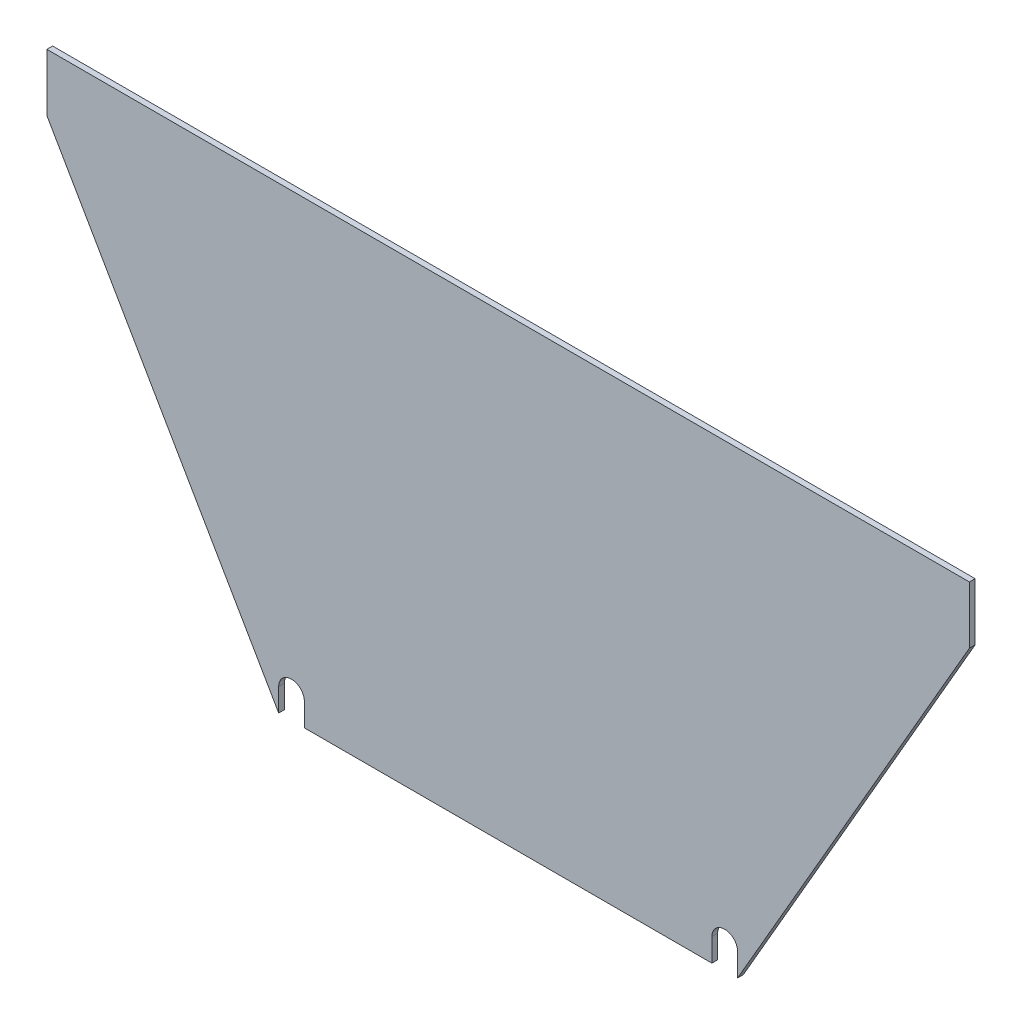
ISO-10303-21;
HEADER;
FILE_DESCRIPTION(('STEP AP214'),'2;1');
FILE_NAME('part.step','',(''),(''),'','','');
FILE_SCHEMA(('AUTOMOTIVE_DESIGN { 1 0 10303 214 1 1 1 1 }'));
ENDSEC;
DATA;
#1=APPLICATION_CONTEXT('core data for automotive mechanical design processes');
#2=APPLICATION_PROTOCOL_DEFINITION('international standard','automotive_design',2000,#1);
#3=PRODUCT_CONTEXT('',#1,'mechanical');
#4=PRODUCT('Part','Part','',(#3));
#5=PRODUCT_RELATED_PRODUCT_CATEGORY('part','',(#4));
#6=PRODUCT_DEFINITION_FORMATION('','',#4);
#7=PRODUCT_DEFINITION_CONTEXT('part definition',#1,'design');
#8=PRODUCT_DEFINITION('design','',#6,#7);
#9=PRODUCT_DEFINITION_SHAPE('','',#8);
#10=(LENGTH_UNIT() NAMED_UNIT(*) SI_UNIT(.MILLI.,.METRE.));
#11=(NAMED_UNIT(*) PLANE_ANGLE_UNIT() SI_UNIT($,.RADIAN.));
#12=(NAMED_UNIT(*) SI_UNIT($,.STERADIAN.) SOLID_ANGLE_UNIT());
#13=UNCERTAINTY_MEASURE_WITH_UNIT(LENGTH_MEASURE(1.E-05),#10,'distance_accuracy_value','');
#14=(GEOMETRIC_REPRESENTATION_CONTEXT(3) GLOBAL_UNCERTAINTY_ASSIGNED_CONTEXT((#13)) GLOBAL_UNIT_ASSIGNED_CONTEXT((#10,
#11,#12)) REPRESENTATION_CONTEXT('',''));
#15=CARTESIAN_POINT('',(0.,0.,0.));
#16=DIRECTION('',(0.,0.,1.));
#17=DIRECTION('',(1.,0.,0.));
#18=AXIS2_PLACEMENT_3D('',#15,#16,#17);
#19=CARTESIAN_POINT('',(0.,0.,6.35));
#20=DIRECTION('',(0.,0.,1.));
#21=DIRECTION('',(1.,0.,0.));
#22=AXIS2_PLACEMENT_3D('',#19,#20,#21);
#23=PLANE('',#22);
#24=DIRECTION('',(0.500000000000017,-0.866025403784429,0.));
#25=VECTOR('',#24,1.);
#26=CARTESIAN_POINT('',(-256.632194654828,444.5,6.35));
#27=LINE('',#26,#25);
#28=CARTESIAN_POINT('',(-1.38962915248915E-11,-1.21939495537996E-11,6.35));
#29=VERTEX_POINT('',#28);
#30=CARTESIAN_POINT('',(-256.632194654828,444.5,6.35));
#31=VERTEX_POINT('',#30);
#32=EDGE_CURVE('E141',#29,#31,#27,.F.);
#33=ORIENTED_EDGE('',*,*,#32,.F.);
#34=DIRECTION('',(0.,1.,0.));
#35=VECTOR('',#34,1.);
#36=CARTESIAN_POINT('',(0.,0.,6.35));
#37=LINE('',#36,#35);
#38=CARTESIAN_POINT('',(0.,25.4,6.35));
#39=VERTEX_POINT('',#38);
#40=EDGE_CURVE('E102',#29,#39,#37,.T.);
#41=ORIENTED_EDGE('',*,*,#40,.T.);
#42=CARTESIAN_POINT('',(14.2136419181508,25.4,6.35));
#43=DIRECTION('',(0.,0.,-1.));
#44=DIRECTION('',(-1.,0.,0.));
#45=AXIS2_PLACEMENT_3D('',#42,#43,#44);
#46=CIRCLE('',#45,14.2136419181508);
#47=CARTESIAN_POINT('',(28.4272838363016,25.4,6.35));
#48=VERTEX_POINT('',#47);
#49=EDGE_CURVE('E20',#39,#48,#46,.T.);
#50=ORIENTED_EDGE('',*,*,#49,.T.);
#51=DIRECTION('',(0.,1.,0.));
#52=VECTOR('',#51,1.);
#53=CARTESIAN_POINT('',(28.4272838363016,25.4,6.35));
#54=LINE('',#53,#52);
#55=CARTESIAN_POINT('',(28.4272838363016,0.,6.35));
#56=VERTEX_POINT('',#55);
#57=EDGE_CURVE('E106',#48,#56,#54,.F.);
#58=ORIENTED_EDGE('',*,*,#57,.T.);
#59=DIRECTION('',(1.,0.,0.));
#60=VECTOR('',#59,1.);
#61=CARTESIAN_POINT('',(0.,0.,6.35));
#62=LINE('',#61,#60);
#63=CARTESIAN_POINT('',(479.5727161638,0.,6.35));
#64=VERTEX_POINT('',#63);
#65=EDGE_CURVE('E118',#64,#56,#62,.F.);
#66=ORIENTED_EDGE('',*,*,#65,.F.);
#67=DIRECTION('',(0.,1.,0.));
#68=VECTOR('',#67,1.);
#69=CARTESIAN_POINT('',(479.5727161638,0.,6.35));
#70=LINE('',#69,#68);
#71=CARTESIAN_POINT('',(479.572716163775,25.4,6.35));
#72=VERTEX_POINT('',#71);
#73=EDGE_CURVE('E183',#64,#72,#70,.T.);
#74=ORIENTED_EDGE('',*,*,#73,.T.);
#75=CARTESIAN_POINT('',(493.7863580819,25.4,6.35));
#76=DIRECTION('',(0.,0.,-1.));
#77=DIRECTION('',(-1.,0.,0.));
#78=AXIS2_PLACEMENT_3D('',#75,#76,#77);
#79=CIRCLE('',#78,14.2136419181508);
#80=CARTESIAN_POINT('',(508.,25.4,6.35));
#81=VERTEX_POINT('',#80);
#82=EDGE_CURVE('E200',#72,#81,#79,.T.);
#83=ORIENTED_EDGE('',*,*,#82,.T.);
#84=DIRECTION('',(0.,1.,0.));
#85=VECTOR('',#84,1.);
#86=CARTESIAN_POINT('',(508.,25.4,6.35));
#87=LINE('',#86,#85);
#88=CARTESIAN_POINT('',(508.,2.00551869693888E-13,6.35));
#89=VERTEX_POINT('',#88);
#90=EDGE_CURVE('E172',#81,#89,#87,.F.);
#91=ORIENTED_EDGE('',*,*,#90,.T.);
#92=DIRECTION('',(0.500000000000017,0.866025403784429,0.));
#93=VECTOR('',#92,1.);
#94=CARTESIAN_POINT('',(508.,0.,6.35));
#95=LINE('',#94,#93);
#96=CARTESIAN_POINT('',(764.632194654821,444.500000000004,6.35));
#97=VERTEX_POINT('',#96);
#98=EDGE_CURVE('E170',#97,#89,#95,.F.);
#99=ORIENTED_EDGE('',*,*,#98,.F.);
#100=DIRECTION('',(0.,1.,0.));
#101=VECTOR('',#100,1.);
#102=CARTESIAN_POINT('',(764.632194654828,444.5,6.35));
#103=LINE('',#102,#101);
#104=CARTESIAN_POINT('',(764.632194654828,508.,6.35));
#105=VERTEX_POINT('',#104);
#106=EDGE_CURVE('E162',#105,#97,#103,.F.);
#107=ORIENTED_EDGE('',*,*,#106,.F.);
#108=DIRECTION('',(1.,0.,0.));
#109=VECTOR('',#108,1.);
#110=CARTESIAN_POINT('',(764.632194654828,508.,6.35));
#111=LINE('',#110,#109);
#112=CARTESIAN_POINT('',(-256.632194654828,508.,6.35));
#113=VERTEX_POINT('',#112);
#114=EDGE_CURVE('E154',#113,#105,#111,.T.);
#115=ORIENTED_EDGE('',*,*,#114,.F.);
#116=DIRECTION('',(0.,1.,0.));
#117=VECTOR('',#116,1.);
#118=CARTESIAN_POINT('',(-256.632194654828,508.,6.35));
#119=LINE('',#118,#117);
#120=EDGE_CURVE('E146',#31,#113,#119,.T.);
#121=ORIENTED_EDGE('',*,*,#120,.F.);
#122=EDGE_LOOP('',(#33,#41,#50,#58,#66,#74,#83,#91,#99,#107,#115,#121));
#123=FACE_BOUND('',#122,.T.);
#124=ADVANCED_FACE('F17',(#123),#23,.T.);
#125=CARTESIAN_POINT('',(0.,0.,0.));
#126=DIRECTION('',(-1.,0.,0.));
#127=DIRECTION('',(0.,0.,1.));
#128=AXIS2_PLACEMENT_3D('',#125,#126,#127);
#129=PLANE('',#128);
#130=ORIENTED_EDGE('',*,*,#40,.F.);
#131=DIRECTION('',(0.,0.,1.));
#132=VECTOR('',#131,1.);
#133=CARTESIAN_POINT('',(-2.08721928629529E-11,-1.21569421196455E-11,0.));
#134=LINE('',#133,#132);
#135=CARTESIAN_POINT('',(-6.95739762098431E-12,-4.05231403988182E-12,0.));
#136=VERTEX_POINT('',#135);
#137=EDGE_CURVE('E130',#136,#29,#134,.T.);
#138=ORIENTED_EDGE('',*,*,#137,.F.);
#139=DIRECTION('',(0.,1.,0.));
#140=VECTOR('',#139,1.);
#141=CARTESIAN_POINT('',(0.,0.,0.));
#142=LINE('',#141,#140);
#143=CARTESIAN_POINT('',(0.,25.4,0.));
#144=VERTEX_POINT('',#143);
#145=EDGE_CURVE('E133',#136,#144,#142,.T.);
#146=ORIENTED_EDGE('',*,*,#145,.T.);
#147=DIRECTION('',(0.,0.,-1.));
#148=VECTOR('',#147,1.);
#149=CARTESIAN_POINT('',(0.,25.4,0.));
#150=LINE('',#149,#148);
#151=EDGE_CURVE('E112',#144,#39,#150,.F.);
#152=ORIENTED_EDGE('',*,*,#151,.T.);
#153=EDGE_LOOP('',(#130,#138,#146,#152));
#154=FACE_BOUND('',#153,.T.);
#155=ADVANCED_FACE('F373',(#154),#129,.F.);
#156=CARTESIAN_POINT('',(14.2136419181508,25.4,0.));
#157=DIRECTION('',(0.,0.,-1.));
#158=DIRECTION('',(-1.,0.,0.));
#159=AXIS2_PLACEMENT_3D('',#156,#157,#158);
#160=CYLINDRICAL_SURFACE('',#159,14.2136419181508);
#161=ORIENTED_EDGE('',*,*,#49,.F.);
#162=ORIENTED_EDGE('',*,*,#151,.F.);
#163=CARTESIAN_POINT('',(14.2136419181508,25.4,0.));
#164=DIRECTION('',(0.,0.,-1.));
#165=DIRECTION('',(-1.,0.,0.));
#166=AXIS2_PLACEMENT_3D('',#163,#164,#165);
#167=CIRCLE('',#166,14.2136419181508);
#168=CARTESIAN_POINT('',(28.4272838363016,25.4,0.));
#169=VERTEX_POINT('',#168);
#170=EDGE_CURVE('E123',#144,#169,#167,.T.);
#171=ORIENTED_EDGE('',*,*,#170,.T.);
#172=DIRECTION('',(0.,0.,-1.));
#173=VECTOR('',#172,1.);
#174=CARTESIAN_POINT('',(28.4272838363016,25.4,0.));
#175=LINE('',#174,#173);
#176=EDGE_CURVE('E111',#169,#48,#175,.F.);
#177=ORIENTED_EDGE('',*,*,#176,.T.);
#178=EDGE_LOOP('',(#161,#162,#171,#177));
#179=FACE_BOUND('',#178,.T.);
#180=ADVANCED_FACE('F121',(#179),#160,.F.);
#181=CARTESIAN_POINT('',(28.4272838363016,25.4,0.));
#182=DIRECTION('',(1.,0.,0.));
#183=DIRECTION('',(0.,0.,-1.));
#184=AXIS2_PLACEMENT_3D('',#181,#182,#183);
#185=PLANE('',#184);
#186=ORIENTED_EDGE('',*,*,#57,.F.);
#187=ORIENTED_EDGE('',*,*,#176,.F.);
#188=DIRECTION('',(0.,1.,0.));
#189=VECTOR('',#188,1.);
#190=CARTESIAN_POINT('',(28.4272838363016,0.,0.));
#191=LINE('',#190,#189);
#192=CARTESIAN_POINT('',(28.4272838363016,0.,0.));
#193=VERTEX_POINT('',#192);
#194=EDGE_CURVE('E199',#169,#193,#191,.F.);
#195=ORIENTED_EDGE('',*,*,#194,.T.);
#196=DIRECTION('',(0.,0.,-1.));
#197=VECTOR('',#196,1.);
#198=CARTESIAN_POINT('',(28.4272838363016,0.,0.));
#199=LINE('',#198,#197);
#200=EDGE_CURVE('E117',#56,#193,#199,.T.);
#201=ORIENTED_EDGE('',*,*,#200,.F.);
#202=EDGE_LOOP('',(#186,#187,#195,#201));
#203=FACE_BOUND('',#202,.T.);
#204=ADVANCED_FACE('F114',(#203),#185,.F.);
#205=CARTESIAN_POINT('',(0.,0.,0.));
#206=DIRECTION('',(0.,-1.,0.));
#207=DIRECTION('',(0.,0.,-1.));
#208=AXIS2_PLACEMENT_3D('',#205,#206,#207);
#209=PLANE('',#208);
#210=ORIENTED_EDGE('',*,*,#65,.T.);
#211=ORIENTED_EDGE('',*,*,#200,.T.);
#212=DIRECTION('',(1.,0.,0.));
#213=VECTOR('',#212,1.);
#214=CARTESIAN_POINT('',(0.,0.,0.));
#215=LINE('',#214,#213);
#216=CARTESIAN_POINT('',(479.5727161638,0.,0.));
#217=VERTEX_POINT('',#216);
#218=EDGE_CURVE('E218',#193,#217,#215,.T.);
#219=ORIENTED_EDGE('',*,*,#218,.T.);
#220=DIRECTION('',(0.,0.,1.));
#221=VECTOR('',#220,1.);
#222=CARTESIAN_POINT('',(479.5727161638,0.,0.));
#223=LINE('',#222,#221);
#224=EDGE_CURVE('E186',#217,#64,#223,.T.);
#225=ORIENTED_EDGE('',*,*,#224,.T.);
#226=EDGE_LOOP('',(#210,#211,#219,#225));
#227=FACE_BOUND('',#226,.T.);
#228=ADVANCED_FACE('F224',(#227),#209,.T.);
#229=CARTESIAN_POINT('',(479.5727161638,0.,0.));
#230=DIRECTION('',(-1.,0.,0.));
#231=DIRECTION('',(0.,0.,1.));
#232=AXIS2_PLACEMENT_3D('',#229,#230,#231);
#233=PLANE('',#232);
#234=ORIENTED_EDGE('',*,*,#73,.F.);
#235=ORIENTED_EDGE('',*,*,#224,.F.);
#236=DIRECTION('',(0.,1.,0.));
#237=VECTOR('',#236,1.);
#238=CARTESIAN_POINT('',(479.5727161638,0.,0.));
#239=LINE('',#238,#237);
#240=CARTESIAN_POINT('',(479.572716163775,25.4,0.));
#241=VERTEX_POINT('',#240);
#242=EDGE_CURVE('E198',#217,#241,#239,.T.);
#243=ORIENTED_EDGE('',*,*,#242,.T.);
#244=DIRECTION('',(0.,0.,-1.));
#245=VECTOR('',#244,1.);
#246=CARTESIAN_POINT('',(479.572716163749,25.4,0.));
#247=LINE('',#246,#245);
#248=EDGE_CURVE('E185',#241,#72,#247,.F.);
#249=ORIENTED_EDGE('',*,*,#248,.T.);
#250=EDGE_LOOP('',(#234,#235,#243,#249));
#251=FACE_BOUND('',#250,.T.);
#252=ADVANCED_FACE('F264',(#251),#233,.F.);
#253=CARTESIAN_POINT('',(493.7863580819,25.4,0.));
#254=DIRECTION('',(0.,0.,-1.));
#255=DIRECTION('',(-1.,0.,0.));
#256=AXIS2_PLACEMENT_3D('',#253,#254,#255);
#257=CYLINDRICAL_SURFACE('',#256,14.2136419181508);
#258=ORIENTED_EDGE('',*,*,#82,.F.);
#259=ORIENTED_EDGE('',*,*,#248,.F.);
#260=CARTESIAN_POINT('',(493.7863580819,25.4,0.));
#261=DIRECTION('',(0.,0.,-1.));
#262=DIRECTION('',(-1.,0.,0.));
#263=AXIS2_PLACEMENT_3D('',#260,#261,#262);
#264=CIRCLE('',#263,14.2136419181508);
#265=CARTESIAN_POINT('',(508.,25.4,0.));
#266=VERTEX_POINT('',#265);
#267=EDGE_CURVE('E194',#241,#266,#264,.T.);
#268=ORIENTED_EDGE('',*,*,#267,.T.);
#269=DIRECTION('',(0.,0.,-1.));
#270=VECTOR('',#269,1.);
#271=CARTESIAN_POINT('',(508.,25.4,0.));
#272=LINE('',#271,#270);
#273=EDGE_CURVE('E180',#266,#81,#272,.F.);
#274=ORIENTED_EDGE('',*,*,#273,.T.);
#275=EDGE_LOOP('',(#258,#259,#268,#274));
#276=FACE_BOUND('',#275,.T.);
#277=ADVANCED_FACE('F266',(#276),#257,.F.);
#278=CARTESIAN_POINT('',(508.,25.4,0.));
#279=DIRECTION('',(1.,0.,0.));
#280=DIRECTION('',(0.,0.,-1.));
#281=AXIS2_PLACEMENT_3D('',#278,#279,#280);
#282=PLANE('',#281);
#283=ORIENTED_EDGE('',*,*,#90,.F.);
#284=ORIENTED_EDGE('',*,*,#273,.F.);
#285=DIRECTION('',(0.,1.,0.));
#286=VECTOR('',#285,1.);
#287=CARTESIAN_POINT('',(508.,0.,0.));
#288=LINE('',#287,#286);
#289=CARTESIAN_POINT('',(508.,0.,0.));
#290=VERTEX_POINT('',#289);
#291=EDGE_CURVE('E197',#266,#290,#288,.F.);
#292=ORIENTED_EDGE('',*,*,#291,.T.);
#293=DIRECTION('',(0.,0.,1.));
#294=VECTOR('',#293,1.);
#295=CARTESIAN_POINT('',(508.,2.01857113071048E-13,0.));
#296=LINE('',#295,#294);
#297=EDGE_CURVE('E164',#89,#290,#296,.F.);
#298=ORIENTED_EDGE('',*,*,#297,.F.);
#299=EDGE_LOOP('',(#283,#284,#292,#298));
#300=FACE_BOUND('',#299,.T.);
#301=ADVANCED_FACE('F258',(#300),#282,.F.);
#302=CARTESIAN_POINT('',(508.,0.,0.));
#303=DIRECTION('',(0.866025403784429,-0.500000000000017,0.));
#304=DIRECTION('',(0.500000000000017,0.866025403784429,0.));
#305=AXIS2_PLACEMENT_3D('',#302,#303,#304);
#306=PLANE('',#305);
#307=ORIENTED_EDGE('',*,*,#98,.T.);
#308=ORIENTED_EDGE('',*,*,#297,.T.);
#309=DIRECTION('',(0.500000000000058,0.866025403784406,0.));
#310=VECTOR('',#309,1.);
#311=CARTESIAN_POINT('',(508.,0.,0.));
#312=LINE('',#311,#310);
#313=CARTESIAN_POINT('',(764.632194654818,444.500000000006,0.));
#314=VERTEX_POINT('',#313);
#315=EDGE_CURVE('E241',#290,#314,#312,.T.);
#316=ORIENTED_EDGE('',*,*,#315,.T.);
#317=DIRECTION('',(0.,0.,-1.));
#318=VECTOR('',#317,1.);
#319=CARTESIAN_POINT('',(764.632194654828,444.5,0.));
#320=LINE('',#319,#318);
#321=EDGE_CURVE('E156',#97,#314,#320,.T.);
#322=ORIENTED_EDGE('',*,*,#321,.F.);
#323=EDGE_LOOP('',(#307,#308,#316,#322));
#324=FACE_BOUND('',#323,.T.);
#325=ADVANCED_FACE('F249',(#324),#306,.T.);
#326=CARTESIAN_POINT('',(764.632194654828,444.5,0.));
#327=DIRECTION('',(1.,0.,0.));
#328=DIRECTION('',(0.,0.,-1.));
#329=AXIS2_PLACEMENT_3D('',#326,#327,#328);
#330=PLANE('',#329);
#331=ORIENTED_EDGE('',*,*,#321,.T.);
#332=DIRECTION('',(0.,1.,0.));
#333=VECTOR('',#332,1.);
#334=CARTESIAN_POINT('',(764.632194654828,0.,0.));
#335=LINE('',#334,#333);
#336=CARTESIAN_POINT('',(764.632194654828,508.,0.));
#337=VERTEX_POINT('',#336);
#338=EDGE_CURVE('E244',#314,#337,#335,.T.);
#339=ORIENTED_EDGE('',*,*,#338,.T.);
#340=DIRECTION('',(0.,0.,1.));
#341=VECTOR('',#340,1.);
#342=CARTESIAN_POINT('',(764.632194654828,508.,0.));
#343=LINE('',#342,#341);
#344=EDGE_CURVE('E148',#105,#337,#343,.F.);
#345=ORIENTED_EDGE('',*,*,#344,.F.);
#346=ORIENTED_EDGE('',*,*,#106,.T.);
#347=EDGE_LOOP('',(#331,#339,#345,#346));
#348=FACE_BOUND('',#347,.T.);
#349=ADVANCED_FACE('F291',(#348),#330,.T.);
#350=CARTESIAN_POINT('',(764.632194654828,508.,0.));
#351=DIRECTION('',(0.,1.,0.));
#352=DIRECTION('',(0.,0.,1.));
#353=AXIS2_PLACEMENT_3D('',#350,#351,#352);
#354=PLANE('',#353);
#355=ORIENTED_EDGE('',*,*,#344,.T.);
#356=DIRECTION('',(1.,0.,0.));
#357=VECTOR('',#356,1.);
#358=CARTESIAN_POINT('',(0.,508.,0.));
#359=LINE('',#358,#357);
#360=CARTESIAN_POINT('',(-256.632194654828,508.,0.));
#361=VERTEX_POINT('',#360);
#362=EDGE_CURVE('E401',#337,#361,#359,.F.);
#363=ORIENTED_EDGE('',*,*,#362,.T.);
#364=DIRECTION('',(0.,0.,1.));
#365=VECTOR('',#364,1.);
#366=CARTESIAN_POINT('',(-256.632194654828,508.,0.));
#367=LINE('',#366,#365);
#368=EDGE_CURVE('E143',#113,#361,#367,.F.);
#369=ORIENTED_EDGE('',*,*,#368,.F.);
#370=ORIENTED_EDGE('',*,*,#114,.T.);
#371=EDGE_LOOP('',(#355,#363,#369,#370));
#372=FACE_BOUND('',#371,.T.);
#373=ADVANCED_FACE('F287',(#372),#354,.T.);
#374=CARTESIAN_POINT('',(-256.632194654828,508.,0.));
#375=DIRECTION('',(-1.,0.,0.));
#376=DIRECTION('',(0.,0.,1.));
#377=AXIS2_PLACEMENT_3D('',#374,#375,#376);
#378=PLANE('',#377);
#379=ORIENTED_EDGE('',*,*,#368,.T.);
#380=DIRECTION('',(0.,1.,0.));
#381=VECTOR('',#380,1.);
#382=CARTESIAN_POINT('',(-256.632194654828,0.,0.));
#383=LINE('',#382,#381);
#384=CARTESIAN_POINT('',(-256.632194654828,444.5,0.));
#385=VERTEX_POINT('',#384);
#386=EDGE_CURVE('E26',#361,#385,#383,.F.);
#387=ORIENTED_EDGE('',*,*,#386,.T.);
#388=DIRECTION('',(0.,0.,1.));
#389=VECTOR('',#388,1.);
#390=CARTESIAN_POINT('',(-256.632194654828,444.5,0.));
#391=LINE('',#390,#389);
#392=EDGE_CURVE('E34',#31,#385,#391,.F.);
#393=ORIENTED_EDGE('',*,*,#392,.F.);
#394=ORIENTED_EDGE('',*,*,#120,.T.);
#395=EDGE_LOOP('',(#379,#387,#393,#394));
#396=FACE_BOUND('',#395,.T.);
#397=ADVANCED_FACE('F282',(#396),#378,.T.);
#398=CARTESIAN_POINT('',(-256.632194654828,444.5,0.));
#399=DIRECTION('',(-0.866025403784429,-0.500000000000017,0.));
#400=DIRECTION('',(0.500000000000017,-0.866025403784429,0.));
#401=AXIS2_PLACEMENT_3D('',#398,#399,#400);
#402=PLANE('',#401);
#403=DIRECTION('',(0.500000000000058,-0.866025403784406,0.));
#404=VECTOR('',#403,1.);
#405=CARTESIAN_POINT('',(-256.632194654828,444.5,0.));
#406=LINE('',#405,#404);
#407=EDGE_CURVE('E11',#385,#136,#406,.T.);
#408=ORIENTED_EDGE('',*,*,#407,.T.);
#409=ORIENTED_EDGE('',*,*,#137,.T.);
#410=ORIENTED_EDGE('',*,*,#32,.T.);
#411=ORIENTED_EDGE('',*,*,#392,.T.);
#412=EDGE_LOOP('',(#408,#409,#410,#411));
#413=FACE_BOUND('',#412,.T.);
#414=ADVANCED_FACE('F277',(#413),#402,.T.);
#415=CARTESIAN_POINT('',(0.,0.,0.));
#416=DIRECTION('',(0.,0.,1.));
#417=DIRECTION('',(1.,0.,0.));
#418=AXIS2_PLACEMENT_3D('',#415,#416,#417);
#419=PLANE('',#418);
#420=ORIENTED_EDGE('',*,*,#386,.F.);
#421=ORIENTED_EDGE('',*,*,#362,.F.);
#422=ORIENTED_EDGE('',*,*,#338,.F.);
#423=ORIENTED_EDGE('',*,*,#315,.F.);
#424=ORIENTED_EDGE('',*,*,#291,.F.);
#425=ORIENTED_EDGE('',*,*,#267,.F.);
#426=ORIENTED_EDGE('',*,*,#242,.F.);
#427=ORIENTED_EDGE('',*,*,#218,.F.);
#428=ORIENTED_EDGE('',*,*,#194,.F.);
#429=ORIENTED_EDGE('',*,*,#170,.F.);
#430=ORIENTED_EDGE('',*,*,#145,.F.);
#431=ORIENTED_EDGE('',*,*,#407,.F.);
#432=EDGE_LOOP('',(#420,#421,#422,#423,#424,#425,#426,#427,#428,#429,#430,#431));
#433=FACE_BOUND('',#432,.T.);
#434=ADVANCED_FACE('F228',(#433),#419,.F.);
#435=CLOSED_SHELL('',(#124,#155,#180,#204,#228,#252,#277,#301,#325,#349,#373,#397,#414,#434));
#436=MANIFOLD_SOLID_BREP('B1',#435);
#437=ADVANCED_BREP_SHAPE_REPRESENTATION('',(#18,#436),#14);
#438=SHAPE_DEFINITION_REPRESENTATION(#9,#437);
ENDSEC;
END-ISO-10303-21;
